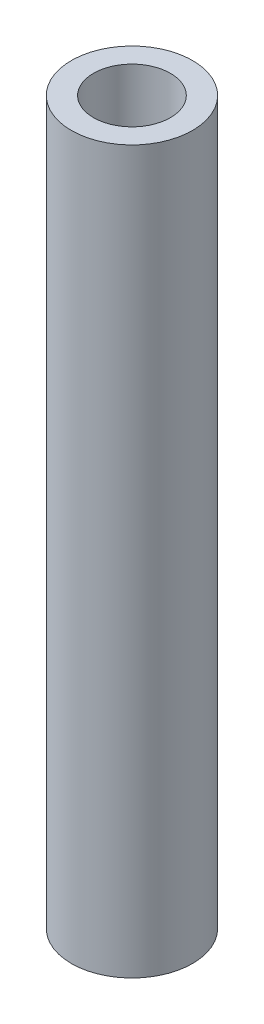
ISO-10303-21;
HEADER;
FILE_DESCRIPTION(('STEP AP214'),'2;1');
FILE_NAME('part.step','',(''),(''),'','','');
FILE_SCHEMA(('AUTOMOTIVE_DESIGN { 1 0 10303 214 1 1 1 1 }'));
ENDSEC;
DATA;
#1=APPLICATION_CONTEXT('core data for automotive mechanical design processes');
#2=APPLICATION_PROTOCOL_DEFINITION('international standard','automotive_design',2000,#1);
#3=PRODUCT_CONTEXT('',#1,'mechanical');
#4=PRODUCT('Part','Part','',(#3));
#5=PRODUCT_RELATED_PRODUCT_CATEGORY('part','',(#4));
#6=PRODUCT_DEFINITION_FORMATION('','',#4);
#7=PRODUCT_DEFINITION_CONTEXT('part definition',#1,'design');
#8=PRODUCT_DEFINITION('design','',#6,#7);
#9=PRODUCT_DEFINITION_SHAPE('','',#8);
#10=(LENGTH_UNIT() NAMED_UNIT(*) SI_UNIT(.MILLI.,.METRE.));
#11=(NAMED_UNIT(*) PLANE_ANGLE_UNIT() SI_UNIT($,.RADIAN.));
#12=(NAMED_UNIT(*) SI_UNIT($,.STERADIAN.) SOLID_ANGLE_UNIT());
#13=UNCERTAINTY_MEASURE_WITH_UNIT(LENGTH_MEASURE(1.E-05),#10,'distance_accuracy_value','');
#14=(GEOMETRIC_REPRESENTATION_CONTEXT(3) GLOBAL_UNCERTAINTY_ASSIGNED_CONTEXT((#13)) GLOBAL_UNIT_ASSIGNED_CONTEXT((#10,
#11,#12)) REPRESENTATION_CONTEXT('',''));
#15=CARTESIAN_POINT('',(0.,0.,0.));
#16=DIRECTION('',(0.,0.,1.));
#17=DIRECTION('',(1.,0.,0.));
#18=AXIS2_PLACEMENT_3D('',#15,#16,#17);
#19=CARTESIAN_POINT('',(0.,24.405,0.));
#20=DIRECTION('',(0.,1.,0.));
#21=DIRECTION('',(0.,0.,1.));
#22=AXIS2_PLACEMENT_3D('',#19,#20,#21);
#23=PLANE('',#22);
#24=CARTESIAN_POINT('',(0.,24.405,0.));
#25=DIRECTION('',(0.,1.,0.));
#26=DIRECTION('',(0.,0.,1.));
#27=AXIS2_PLACEMENT_3D('',#24,#25,#26);
#28=CIRCLE('',#27,4.1);
#29=CARTESIAN_POINT('',(0.,24.405,4.1));
#30=VERTEX_POINT('',#29);
#31=EDGE_CURVE('E10',#30,#30,#28,.T.);
#32=ORIENTED_EDGE('',*,*,#31,.T.);
#33=EDGE_LOOP('',(#32));
#34=FACE_BOUND('',#33,.T.);
#35=CARTESIAN_POINT('',(0.,24.405,0.));
#36=DIRECTION('',(0.,1.,0.));
#37=DIRECTION('',(0.,0.,1.));
#38=AXIS2_PLACEMENT_3D('',#35,#36,#37);
#39=CIRCLE('',#38,2.60225204922744);
#40=CARTESIAN_POINT('',(0.,24.405,2.60225204922744));
#41=VERTEX_POINT('',#40);
#42=EDGE_CURVE('E50',#41,#41,#39,.T.);
#43=ORIENTED_EDGE('',*,*,#42,.F.);
#44=EDGE_LOOP('',(#43));
#45=FACE_BOUND('',#44,.T.);
#46=ADVANCED_FACE('F39',(#34,#45),#23,.T.);
#47=CARTESIAN_POINT('',(0.,-24.405,0.));
#48=DIRECTION('',(0.,1.,0.));
#49=DIRECTION('',(0.,0.,1.));
#50=AXIS2_PLACEMENT_3D('',#47,#48,#49);
#51=PLANE('',#50);
#52=CARTESIAN_POINT('',(0.,-24.405,0.));
#53=DIRECTION('',(0.,1.,0.));
#54=DIRECTION('',(0.,0.,1.));
#55=AXIS2_PLACEMENT_3D('',#52,#53,#54);
#56=CIRCLE('',#55,4.1);
#57=CARTESIAN_POINT('',(0.,-24.405,4.1));
#58=VERTEX_POINT('',#57);
#59=EDGE_CURVE('E43',#58,#58,#56,.T.);
#60=ORIENTED_EDGE('',*,*,#59,.F.);
#61=EDGE_LOOP('',(#60));
#62=FACE_BOUND('',#61,.T.);
#63=CARTESIAN_POINT('',(0.,-24.405,0.));
#64=DIRECTION('',(0.,1.,0.));
#65=DIRECTION('',(0.,0.,1.));
#66=AXIS2_PLACEMENT_3D('',#63,#64,#65);
#67=CIRCLE('',#66,2.60225204922744);
#68=CARTESIAN_POINT('',(0.,-24.405,2.60225204922744));
#69=VERTEX_POINT('',#68);
#70=EDGE_CURVE('E52',#69,#69,#67,.T.);
#71=ORIENTED_EDGE('',*,*,#70,.T.);
#72=EDGE_LOOP('',(#71));
#73=FACE_BOUND('',#72,.T.);
#74=ADVANCED_FACE('F62',(#62,#73),#51,.F.);
#75=CARTESIAN_POINT('',(0.,24.405,0.));
#76=DIRECTION('',(0.,-1.,0.));
#77=DIRECTION('',(0.,0.,-1.));
#78=AXIS2_PLACEMENT_3D('',#75,#76,#77);
#79=CYLINDRICAL_SURFACE('',#78,4.1);
#80=ORIENTED_EDGE('',*,*,#31,.F.);
#81=EDGE_LOOP('',(#80));
#82=FACE_BOUND('',#81,.T.);
#83=ORIENTED_EDGE('',*,*,#59,.T.);
#84=EDGE_LOOP('',(#83));
#85=FACE_BOUND('',#84,.T.);
#86=ADVANCED_FACE('F41',(#82,#85),#79,.T.);
#87=CARTESIAN_POINT('',(0.,24.405,0.));
#88=DIRECTION('',(0.,-1.,0.));
#89=DIRECTION('',(0.,0.,-1.));
#90=AXIS2_PLACEMENT_3D('',#87,#88,#89);
#91=CYLINDRICAL_SURFACE('',#90,2.60225204922744);
#92=ORIENTED_EDGE('',*,*,#42,.T.);
#93=EDGE_LOOP('',(#92));
#94=FACE_BOUND('',#93,.T.);
#95=ORIENTED_EDGE('',*,*,#70,.F.);
#96=EDGE_LOOP('',(#95));
#97=FACE_BOUND('',#96,.T.);
#98=ADVANCED_FACE('F58',(#94,#97),#91,.F.);
#99=CLOSED_SHELL('',(#46,#74,#86,#98));
#100=MANIFOLD_SOLID_BREP('B2',#99);
#101=ADVANCED_BREP_SHAPE_REPRESENTATION('',(#18,#100),#14);
#102=SHAPE_DEFINITION_REPRESENTATION(#9,#101);
ENDSEC;
END-ISO-10303-21;
